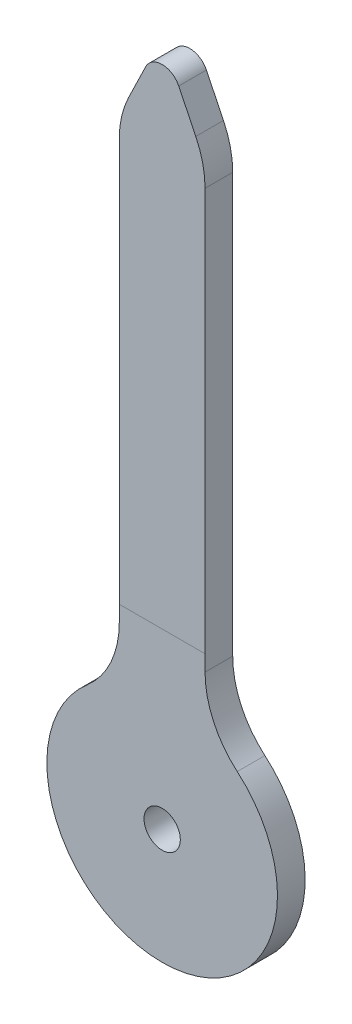
ISO-10303-21;
HEADER;
FILE_DESCRIPTION(('STEP AP214'),'2;1');
FILE_NAME('part.step','',(''),(''),'','','');
FILE_SCHEMA(('AUTOMOTIVE_DESIGN { 1 0 10303 214 1 1 1 1 }'));
ENDSEC;
DATA;
#1=APPLICATION_CONTEXT('core data for automotive mechanical design processes');
#2=APPLICATION_PROTOCOL_DEFINITION('international standard','automotive_design',2000,#1);
#3=PRODUCT_CONTEXT('',#1,'mechanical');
#4=PRODUCT('Part','Part','',(#3));
#5=PRODUCT_RELATED_PRODUCT_CATEGORY('part','',(#4));
#6=PRODUCT_DEFINITION_FORMATION('','',#4);
#7=PRODUCT_DEFINITION_CONTEXT('part definition',#1,'design');
#8=PRODUCT_DEFINITION('design','',#6,#7);
#9=PRODUCT_DEFINITION_SHAPE('','',#8);
#10=(LENGTH_UNIT() NAMED_UNIT(*) SI_UNIT(.MILLI.,.METRE.));
#11=(NAMED_UNIT(*) PLANE_ANGLE_UNIT() SI_UNIT($,.RADIAN.));
#12=(NAMED_UNIT(*) SI_UNIT($,.STERADIAN.) SOLID_ANGLE_UNIT());
#13=UNCERTAINTY_MEASURE_WITH_UNIT(LENGTH_MEASURE(1.E-05),#10,'distance_accuracy_value','');
#14=(GEOMETRIC_REPRESENTATION_CONTEXT(3) GLOBAL_UNCERTAINTY_ASSIGNED_CONTEXT((#13)) GLOBAL_UNIT_ASSIGNED_CONTEXT((#10,
#11,#12)) REPRESENTATION_CONTEXT('',''));
#15=CARTESIAN_POINT('',(0.,0.,0.));
#16=DIRECTION('',(0.,0.,1.));
#17=DIRECTION('',(1.,0.,0.));
#18=AXIS2_PLACEMENT_3D('',#15,#16,#17);
#19=CARTESIAN_POINT('',(0.,17.7300150413986,0.));
#20=DIRECTION('',(0.,0.,-1.));
#21=DIRECTION('',(-1.,0.,0.));
#22=AXIS2_PLACEMENT_3D('',#19,#20,#21);
#23=CYLINDRICAL_SURFACE('',#22,0.50718495860138);
#24=DIRECTION('',(0.,0.,-1.));
#25=VECTOR('',#24,1.);
#26=CARTESIAN_POINT('',(0.45621700816897,17.9516061596521,0.762));
#27=LINE('',#26,#25);
#28=CARTESIAN_POINT('',(0.45621700816897,17.9516061596521,0.));
#29=VERTEX_POINT('',#28);
#30=CARTESIAN_POINT('',(0.45621700816897,17.9516061596521,0.762));
#31=VERTEX_POINT('',#30);
#32=EDGE_CURVE('E203',#29,#31,#27,.F.);
#33=ORIENTED_EDGE('',*,*,#32,.F.);
#34=CARTESIAN_POINT('',(0.,17.7300150413986,0.));
#35=DIRECTION('',(0.,0.,1.));
#36=DIRECTION('',(1.,0.,0.));
#37=AXIS2_PLACEMENT_3D('',#34,#35,#36);
#38=CIRCLE('',#37,0.50718495860138);
#39=CARTESIAN_POINT('',(-0.45621700816897,17.9516061596521,0.));
#40=VERTEX_POINT('',#39);
#41=EDGE_CURVE('E46',#40,#29,#38,.F.);
#42=ORIENTED_EDGE('',*,*,#41,.F.);
#43=DIRECTION('',(0.,0.,-1.));
#44=VECTOR('',#43,1.);
#45=CARTESIAN_POINT('',(-0.45621700816897,17.9516061596521,0.762));
#46=LINE('',#45,#44);
#47=CARTESIAN_POINT('',(-0.45621700816897,17.9516061596521,0.762));
#48=VERTEX_POINT('',#47);
#49=EDGE_CURVE('E206',#48,#40,#46,.T.);
#50=ORIENTED_EDGE('',*,*,#49,.F.);
#51=CARTESIAN_POINT('',(0.,17.7300150413986,0.762));
#52=DIRECTION('',(0.,0.,1.));
#53=DIRECTION('',(1.,0.,0.));
#54=AXIS2_PLACEMENT_3D('',#51,#52,#53);
#55=CIRCLE('',#54,0.50718495860138);
#56=EDGE_CURVE('E12',#31,#48,#55,.T.);
#57=ORIENTED_EDGE('',*,*,#56,.F.);
#58=EDGE_LOOP('',(#33,#42,#50,#57));
#59=FACE_BOUND('',#58,.T.);
#60=ADVANCED_FACE('F39',(#59),#23,.T.);
#61=CARTESIAN_POINT('',(0.,0.,0.762));
#62=DIRECTION('',(0.,0.,1.));
#63=DIRECTION('',(1.,0.,0.));
#64=AXIS2_PLACEMENT_3D('',#61,#62,#63);
#65=PLANE('',#64);
#66=CARTESIAN_POINT('',(0.,0.,0.762));
#67=DIRECTION('',(0.,0.,1.));
#68=DIRECTION('',(1.,0.,0.));
#69=AXIS2_PLACEMENT_3D('',#66,#67,#68);
#70=CIRCLE('',#69,0.5);
#71=CARTESIAN_POINT('',(0.5,0.,0.762));
#72=VERTEX_POINT('',#71);
#73=EDGE_CURVE('E159',#72,#72,#70,.T.);
#74=ORIENTED_EDGE('',*,*,#73,.F.);
#75=EDGE_LOOP('',(#74));
#76=FACE_BOUND('',#75,.T.);
#77=CARTESIAN_POINT('',(0.,0.,0.762));
#78=DIRECTION('',(0.,0.,1.));
#79=DIRECTION('',(1.,0.,0.));
#80=AXIS2_PLACEMENT_3D('',#77,#78,#79);
#81=CIRCLE('',#80,3.175);
#82=CARTESIAN_POINT('',(-2.06727777777778,2.40976919838938,0.762));
#83=VERTEX_POINT('',#82);
#84=CARTESIAN_POINT('',(2.06727777777778,2.40976919838938,0.762));
#85=VERTEX_POINT('',#84);
#86=EDGE_CURVE('E129',#83,#85,#81,.T.);
#87=ORIENTED_EDGE('',*,*,#86,.T.);
#88=CARTESIAN_POINT('',(3.7211,4.33758455710087,0.762));
#89=DIRECTION('',(0.,0.,1.));
#90=DIRECTION('',(1.,0.,0.));
#91=AXIS2_PLACEMENT_3D('',#88,#89,#90);
#92=CIRCLE('',#91,2.54);
#93=CARTESIAN_POINT('',(1.1811,4.33758455710088,0.762));
#94=VERTEX_POINT('',#93);
#95=EDGE_CURVE('E197',#85,#94,#92,.F.);
#96=ORIENTED_EDGE('',*,*,#95,.T.);
#97=DIRECTION('',(0.,1.,0.));
#98=VECTOR('',#97,1.);
#99=CARTESIAN_POINT('',(1.1811,2.94713891596579,0.762));
#100=LINE('',#99,#98);
#101=CARTESIAN_POINT('',(1.1811,4.7752,0.762));
#102=VERTEX_POINT('',#101);
#103=EDGE_CURVE('E138',#94,#102,#100,.T.);
#104=ORIENTED_EDGE('',*,*,#103,.T.);
#105=DIRECTION('',(-1.,0.,0.));
#106=VECTOR('',#105,1.);
#107=CARTESIAN_POINT('',(0.,4.7752,0.762));
#108=LINE('',#107,#106);
#109=CARTESIAN_POINT('',(-1.1811,4.7752,0.762));
#110=VERTEX_POINT('',#109);
#111=EDGE_CURVE('E121',#102,#110,#108,.T.);
#112=ORIENTED_EDGE('',*,*,#111,.T.);
#113=DIRECTION('',(0.,-1.,0.));
#114=VECTOR('',#113,1.);
#115=CARTESIAN_POINT('',(-1.1811,2.94713891596579,0.762));
#116=LINE('',#115,#114);
#117=CARTESIAN_POINT('',(-1.1811,4.33758455710088,0.762));
#118=VERTEX_POINT('',#117);
#119=EDGE_CURVE('E130',#110,#118,#116,.T.);
#120=ORIENTED_EDGE('',*,*,#119,.T.);
#121=CARTESIAN_POINT('',(-3.7211,4.33758455710087,0.762));
#122=DIRECTION('',(0.,0.,1.));
#123=DIRECTION('',(1.,0.,0.));
#124=AXIS2_PLACEMENT_3D('',#121,#122,#123);
#125=CIRCLE('',#124,2.54);
#126=EDGE_CURVE('E201',#118,#83,#125,.F.);
#127=ORIENTED_EDGE('',*,*,#126,.T.);
#128=EDGE_LOOP('',(#87,#96,#104,#112,#120,#127));
#129=FACE_BOUND('',#128,.T.);
#130=ADVANCED_FACE('F135',(#76,#129),#65,.T.);
#131=DIRECTION('',(-0.436903962736914,0.899508158575997,0.));
#132=VECTOR('',#131,1.);
#133=CARTESIAN_POINT('',(1.1811,16.4592,0.762));
#134=LINE('',#133,#132);
#135=CARTESIAN_POINT('',(0.925850722783035,16.9847132177996,0.762));
#136=VERTEX_POINT('',#135);
#137=EDGE_CURVE('E141',#136,#31,#134,.T.);
#138=ORIENTED_EDGE('',*,*,#137,.T.);
#139=ORIENTED_EDGE('',*,*,#56,.T.);
#140=DIRECTION('',(-0.436903962736914,-0.899508158575997,0.));
#141=VECTOR('',#140,1.);
#142=CARTESIAN_POINT('',(-1.1811,16.4592,0.762));
#143=LINE('',#142,#141);
#144=CARTESIAN_POINT('',(-0.925850722783033,16.9847132177996,0.762));
#145=VERTEX_POINT('',#144);
#146=EDGE_CURVE('E147',#48,#145,#143,.T.);
#147=ORIENTED_EDGE('',*,*,#146,.T.);
#148=CARTESIAN_POINT('',(1.3589,15.8749771524479,0.762));
#149=DIRECTION('',(0.,0.,1.));
#150=DIRECTION('',(1.,0.,0.));
#151=AXIS2_PLACEMENT_3D('',#148,#149,#150);
#152=CIRCLE('',#151,2.54);
#153=CARTESIAN_POINT('',(-1.1811,15.8749771524479,0.762));
#154=VERTEX_POINT('',#153);
#155=EDGE_CURVE('E124',#145,#154,#152,.T.);
#156=ORIENTED_EDGE('',*,*,#155,.T.);
#157=EDGE_CURVE('E117',#154,#110,#116,.T.);
#158=ORIENTED_EDGE('',*,*,#157,.T.);
#159=ORIENTED_EDGE('',*,*,#111,.F.);
#160=CARTESIAN_POINT('',(1.1811,15.8749771524479,0.762));
#161=VERTEX_POINT('',#160);
#162=EDGE_CURVE('E153',#102,#161,#100,.T.);
#163=ORIENTED_EDGE('',*,*,#162,.T.);
#164=CARTESIAN_POINT('',(-1.3589,15.8749771524479,0.762));
#165=DIRECTION('',(0.,0.,1.));
#166=DIRECTION('',(1.,0.,0.));
#167=AXIS2_PLACEMENT_3D('',#164,#165,#166);
#168=CIRCLE('',#167,2.54);
#169=EDGE_CURVE('E182',#161,#136,#168,.T.);
#170=ORIENTED_EDGE('',*,*,#169,.T.);
#171=EDGE_LOOP('',(#138,#139,#147,#156,#158,#159,#163,#170));
#172=FACE_BOUND('',#171,.T.);
#173=ADVANCED_FACE('F119',(#172),#65,.T.);
#174=CARTESIAN_POINT('',(0.,0.,0.));
#175=DIRECTION('',(0.,0.,1.));
#176=DIRECTION('',(1.,0.,0.));
#177=AXIS2_PLACEMENT_3D('',#174,#175,#176);
#178=PLANE('',#177);
#179=DIRECTION('',(-0.436903962736914,-0.899508158575997,0.));
#180=VECTOR('',#179,1.);
#181=CARTESIAN_POINT('',(-1.1811,16.4592,0.));
#182=LINE('',#181,#180);
#183=CARTESIAN_POINT('',(-0.925850722783033,16.9847132177996,0.));
#184=VERTEX_POINT('',#183);
#185=EDGE_CURVE('E156',#40,#184,#182,.T.);
#186=ORIENTED_EDGE('',*,*,#185,.F.);
#187=ORIENTED_EDGE('',*,*,#41,.T.);
#188=DIRECTION('',(-0.436903962736914,0.899508158575997,0.));
#189=VECTOR('',#188,1.);
#190=CARTESIAN_POINT('',(1.1811,16.4592,0.));
#191=LINE('',#190,#189);
#192=CARTESIAN_POINT('',(0.925850722783035,16.9847132177996,0.));
#193=VERTEX_POINT('',#192);
#194=EDGE_CURVE('E148',#193,#29,#191,.T.);
#195=ORIENTED_EDGE('',*,*,#194,.F.);
#196=CARTESIAN_POINT('',(-1.3589,15.8749771524479,0.));
#197=DIRECTION('',(0.,0.,1.));
#198=DIRECTION('',(1.,0.,0.));
#199=AXIS2_PLACEMENT_3D('',#196,#197,#198);
#200=CIRCLE('',#199,2.54);
#201=CARTESIAN_POINT('',(1.1811,15.8749771524479,0.));
#202=VERTEX_POINT('',#201);
#203=EDGE_CURVE('E174',#193,#202,#200,.F.);
#204=ORIENTED_EDGE('',*,*,#203,.T.);
#205=DIRECTION('',(0.,1.,0.));
#206=VECTOR('',#205,1.);
#207=CARTESIAN_POINT('',(1.1811,2.94713891596579,0.));
#208=LINE('',#207,#206);
#209=CARTESIAN_POINT('',(1.1811,4.33758455710088,0.));
#210=VERTEX_POINT('',#209);
#211=EDGE_CURVE('E164',#210,#202,#208,.T.);
#212=ORIENTED_EDGE('',*,*,#211,.F.);
#213=CARTESIAN_POINT('',(3.7211,4.33758455710087,0.));
#214=DIRECTION('',(0.,0.,1.));
#215=DIRECTION('',(1.,0.,0.));
#216=AXIS2_PLACEMENT_3D('',#213,#214,#215);
#217=CIRCLE('',#216,2.54);
#218=CARTESIAN_POINT('',(2.06727777777778,2.40976919838938,0.));
#219=VERTEX_POINT('',#218);
#220=EDGE_CURVE('E195',#210,#219,#217,.T.);
#221=ORIENTED_EDGE('',*,*,#220,.T.);
#222=CARTESIAN_POINT('',(0.,0.,0.));
#223=DIRECTION('',(0.,0.,1.));
#224=DIRECTION('',(1.,0.,0.));
#225=AXIS2_PLACEMENT_3D('',#222,#223,#224);
#226=CIRCLE('',#225,3.175);
#227=CARTESIAN_POINT('',(-2.06727777777778,2.40976919838938,0.));
#228=VERTEX_POINT('',#227);
#229=EDGE_CURVE('E161',#228,#219,#226,.T.);
#230=ORIENTED_EDGE('',*,*,#229,.F.);
#231=CARTESIAN_POINT('',(-3.7211,4.33758455710087,0.));
#232=DIRECTION('',(0.,0.,1.));
#233=DIRECTION('',(1.,0.,0.));
#234=AXIS2_PLACEMENT_3D('',#231,#232,#233);
#235=CIRCLE('',#234,2.54);
#236=CARTESIAN_POINT('',(-1.1811,4.33758455710088,0.));
#237=VERTEX_POINT('',#236);
#238=EDGE_CURVE('E199',#228,#237,#235,.T.);
#239=ORIENTED_EDGE('',*,*,#238,.T.);
#240=DIRECTION('',(0.,-1.,0.));
#241=VECTOR('',#240,1.);
#242=CARTESIAN_POINT('',(-1.1811,2.94713891596579,0.));
#243=LINE('',#242,#241);
#244=CARTESIAN_POINT('',(-1.1811,15.8749771524479,0.));
#245=VERTEX_POINT('',#244);
#246=EDGE_CURVE('E158',#245,#237,#243,.T.);
#247=ORIENTED_EDGE('',*,*,#246,.F.);
#248=CARTESIAN_POINT('',(1.3589,15.8749771524479,0.));
#249=DIRECTION('',(0.,0.,1.));
#250=DIRECTION('',(1.,0.,0.));
#251=AXIS2_PLACEMENT_3D('',#248,#249,#250);
#252=CIRCLE('',#251,2.54);
#253=EDGE_CURVE('E171',#245,#184,#252,.F.);
#254=ORIENTED_EDGE('',*,*,#253,.T.);
#255=EDGE_LOOP('',(#186,#187,#195,#204,#212,#221,#230,#239,#247,#254));
#256=FACE_BOUND('',#255,.T.);
#257=CARTESIAN_POINT('',(0.,0.,0.));
#258=DIRECTION('',(0.,0.,1.));
#259=DIRECTION('',(1.,0.,0.));
#260=AXIS2_PLACEMENT_3D('',#257,#258,#259);
#261=CIRCLE('',#260,0.5);
#262=CARTESIAN_POINT('',(0.5,0.,0.));
#263=VERTEX_POINT('',#262);
#264=EDGE_CURVE('E367',#263,#263,#261,.T.);
#265=ORIENTED_EDGE('',*,*,#264,.T.);
#266=EDGE_LOOP('',(#265));
#267=FACE_BOUND('',#266,.T.);
#268=ADVANCED_FACE('F210',(#256,#267),#178,.F.);
#269=CARTESIAN_POINT('',(-1.1811,16.4592,0.762));
#270=DIRECTION('',(0.899508158575997,-0.436903962736914,0.));
#271=DIRECTION('',(0.436903962736914,0.899508158575997,0.));
#272=AXIS2_PLACEMENT_3D('',#269,#270,#271);
#273=PLANE('',#272);
#274=ORIENTED_EDGE('',*,*,#146,.F.);
#275=ORIENTED_EDGE('',*,*,#49,.T.);
#276=ORIENTED_EDGE('',*,*,#185,.T.);
#277=DIRECTION('',(0.,0.,-1.));
#278=VECTOR('',#277,1.);
#279=CARTESIAN_POINT('',(-0.925850722783033,16.9847132177996,0.762));
#280=LINE('',#279,#278);
#281=EDGE_CURVE('E187',#184,#145,#280,.F.);
#282=ORIENTED_EDGE('',*,*,#281,.T.);
#283=EDGE_LOOP('',(#274,#275,#276,#282));
#284=FACE_BOUND('',#283,.T.);
#285=ADVANCED_FACE('F241',(#284),#273,.F.);
#286=CARTESIAN_POINT('',(-1.1811,2.94713891596579,0.762));
#287=DIRECTION('',(1.,0.,0.));
#288=DIRECTION('',(0.,1.,0.));
#289=AXIS2_PLACEMENT_3D('',#286,#287,#288);
#290=PLANE('',#289);
#291=ORIENTED_EDGE('',*,*,#157,.F.);
#292=DIRECTION('',(0.,0.,-1.));
#293=VECTOR('',#292,1.);
#294=CARTESIAN_POINT('',(-1.1811,15.8749771524479,0.762));
#295=LINE('',#294,#293);
#296=EDGE_CURVE('E185',#154,#245,#295,.T.);
#297=ORIENTED_EDGE('',*,*,#296,.T.);
#298=ORIENTED_EDGE('',*,*,#246,.T.);
#299=DIRECTION('',(0.,0.,1.));
#300=VECTOR('',#299,1.);
#301=CARTESIAN_POINT('',(-1.1811,4.33758455710088,0.762));
#302=LINE('',#301,#300);
#303=EDGE_CURVE('E146',#237,#118,#302,.T.);
#304=ORIENTED_EDGE('',*,*,#303,.T.);
#305=ORIENTED_EDGE('',*,*,#119,.F.);
#306=EDGE_LOOP('',(#291,#297,#298,#304,#305));
#307=FACE_BOUND('',#306,.T.);
#308=ADVANCED_FACE('F143',(#307),#290,.F.);
#309=CARTESIAN_POINT('',(0.,0.,0.762));
#310=DIRECTION('',(0.,0.,-1.));
#311=DIRECTION('',(-1.,0.,0.));
#312=AXIS2_PLACEMENT_3D('',#309,#310,#311);
#313=CYLINDRICAL_SURFACE('',#312,3.175);
#314=ORIENTED_EDGE('',*,*,#229,.T.);
#315=DIRECTION('',(0.,0.,-1.));
#316=VECTOR('',#315,1.);
#317=CARTESIAN_POINT('',(2.06727777777778,2.40976919838938,0.762));
#318=LINE('',#317,#316);
#319=EDGE_CURVE('E193',#219,#85,#318,.F.);
#320=ORIENTED_EDGE('',*,*,#319,.T.);
#321=ORIENTED_EDGE('',*,*,#86,.F.);
#322=DIRECTION('',(0.,0.,-1.));
#323=VECTOR('',#322,1.);
#324=CARTESIAN_POINT('',(-2.06727777777778,2.40976919838938,0.762));
#325=LINE('',#324,#323);
#326=EDGE_CURVE('E190',#83,#228,#325,.T.);
#327=ORIENTED_EDGE('',*,*,#326,.T.);
#328=EDGE_LOOP('',(#314,#320,#321,#327));
#329=FACE_BOUND('',#328,.T.);
#330=ADVANCED_FACE('F230',(#329),#313,.T.);
#331=CARTESIAN_POINT('',(1.1811,2.94713891596579,0.762));
#332=DIRECTION('',(-1.,0.,0.));
#333=DIRECTION('',(0.,-1.,0.));
#334=AXIS2_PLACEMENT_3D('',#331,#332,#333);
#335=PLANE('',#334);
#336=ORIENTED_EDGE('',*,*,#211,.T.);
#337=DIRECTION('',(0.,0.,-1.));
#338=VECTOR('',#337,1.);
#339=CARTESIAN_POINT('',(1.1811,15.8749771524479,0.762));
#340=LINE('',#339,#338);
#341=EDGE_CURVE('E179',#202,#161,#340,.F.);
#342=ORIENTED_EDGE('',*,*,#341,.T.);
#343=ORIENTED_EDGE('',*,*,#162,.F.);
#344=ORIENTED_EDGE('',*,*,#103,.F.);
#345=DIRECTION('',(0.,0.,1.));
#346=VECTOR('',#345,1.);
#347=CARTESIAN_POINT('',(1.1811,4.33758455710088,0.));
#348=LINE('',#347,#346);
#349=EDGE_CURVE('E176',#94,#210,#348,.F.);
#350=ORIENTED_EDGE('',*,*,#349,.T.);
#351=EDGE_LOOP('',(#336,#342,#343,#344,#350));
#352=FACE_BOUND('',#351,.T.);
#353=ADVANCED_FACE('F222',(#352),#335,.F.);
#354=CARTESIAN_POINT('',(1.1811,16.4592,0.762));
#355=DIRECTION('',(-0.899508158575997,-0.436903962736914,0.));
#356=DIRECTION('',(0.436903962736914,-0.899508158575997,0.));
#357=AXIS2_PLACEMENT_3D('',#354,#355,#356);
#358=PLANE('',#357);
#359=ORIENTED_EDGE('',*,*,#194,.T.);
#360=ORIENTED_EDGE('',*,*,#32,.T.);
#361=ORIENTED_EDGE('',*,*,#137,.F.);
#362=DIRECTION('',(0.,0.,-1.));
#363=VECTOR('',#362,1.);
#364=CARTESIAN_POINT('',(0.925850722783034,16.9847132177996,0.762));
#365=LINE('',#364,#363);
#366=EDGE_CURVE('E140',#136,#193,#365,.T.);
#367=ORIENTED_EDGE('',*,*,#366,.T.);
#368=EDGE_LOOP('',(#359,#360,#361,#367));
#369=FACE_BOUND('',#368,.T.);
#370=ADVANCED_FACE('F214',(#369),#358,.F.);
#371=CARTESIAN_POINT('',(0.,0.,0.762));
#372=DIRECTION('',(0.,0.,-1.));
#373=DIRECTION('',(-1.,0.,0.));
#374=AXIS2_PLACEMENT_3D('',#371,#372,#373);
#375=CYLINDRICAL_SURFACE('',#374,0.5);
#376=ORIENTED_EDGE('',*,*,#73,.T.);
#377=EDGE_LOOP('',(#376));
#378=FACE_BOUND('',#377,.T.);
#379=ORIENTED_EDGE('',*,*,#264,.F.);
#380=EDGE_LOOP('',(#379));
#381=FACE_BOUND('',#380,.T.);
#382=ADVANCED_FACE('F262',(#378,#381),#375,.F.);
#383=CARTESIAN_POINT('',(-1.3589,15.8749771524479,0.762));
#384=DIRECTION('',(0.,0.,-1.));
#385=DIRECTION('',(-1.,0.,0.));
#386=AXIS2_PLACEMENT_3D('',#383,#384,#385);
#387=CYLINDRICAL_SURFACE('',#386,2.54);
#388=ORIENTED_EDGE('',*,*,#169,.F.);
#389=ORIENTED_EDGE('',*,*,#341,.F.);
#390=ORIENTED_EDGE('',*,*,#203,.F.);
#391=ORIENTED_EDGE('',*,*,#366,.F.);
#392=EDGE_LOOP('',(#388,#389,#390,#391));
#393=FACE_BOUND('',#392,.T.);
#394=ADVANCED_FACE('F218',(#393),#387,.T.);
#395=CARTESIAN_POINT('',(1.3589,15.8749771524479,0.762));
#396=DIRECTION('',(0.,0.,-1.));
#397=DIRECTION('',(-1.,0.,0.));
#398=AXIS2_PLACEMENT_3D('',#395,#396,#397);
#399=CYLINDRICAL_SURFACE('',#398,2.54);
#400=ORIENTED_EDGE('',*,*,#155,.F.);
#401=ORIENTED_EDGE('',*,*,#281,.F.);
#402=ORIENTED_EDGE('',*,*,#253,.F.);
#403=ORIENTED_EDGE('',*,*,#296,.F.);
#404=EDGE_LOOP('',(#400,#401,#402,#403));
#405=FACE_BOUND('',#404,.T.);
#406=ADVANCED_FACE('F237',(#405),#399,.T.);
#407=CARTESIAN_POINT('',(3.7211,4.33758455710087,0.762));
#408=DIRECTION('',(0.,0.,-1.));
#409=DIRECTION('',(-1.,0.,0.));
#410=AXIS2_PLACEMENT_3D('',#407,#408,#409);
#411=CYLINDRICAL_SURFACE('',#410,2.54);
#412=ORIENTED_EDGE('',*,*,#95,.F.);
#413=ORIENTED_EDGE('',*,*,#319,.F.);
#414=ORIENTED_EDGE('',*,*,#220,.F.);
#415=ORIENTED_EDGE('',*,*,#349,.F.);
#416=EDGE_LOOP('',(#412,#413,#414,#415));
#417=FACE_BOUND('',#416,.T.);
#418=ADVANCED_FACE('F226',(#417),#411,.F.);
#419=CARTESIAN_POINT('',(-3.7211,4.33758455710087,0.762));
#420=DIRECTION('',(0.,0.,-1.));
#421=DIRECTION('',(-1.,0.,0.));
#422=AXIS2_PLACEMENT_3D('',#419,#420,#421);
#423=CYLINDRICAL_SURFACE('',#422,2.54);
#424=ORIENTED_EDGE('',*,*,#126,.F.);
#425=ORIENTED_EDGE('',*,*,#303,.F.);
#426=ORIENTED_EDGE('',*,*,#238,.F.);
#427=ORIENTED_EDGE('',*,*,#326,.F.);
#428=EDGE_LOOP('',(#424,#425,#426,#427));
#429=FACE_BOUND('',#428,.T.);
#430=ADVANCED_FACE('F234',(#429),#423,.F.);
#431=CLOSED_SHELL('',(#60,#130,#173,#268,#285,#308,#330,#353,#370,#382,#394,#406,#418,#430));
#432=MANIFOLD_SOLID_BREP('B2',#431);
#433=ADVANCED_BREP_SHAPE_REPRESENTATION('',(#18,#432),#14);
#434=SHAPE_DEFINITION_REPRESENTATION(#9,#433);
ENDSEC;
END-ISO-10303-21;
